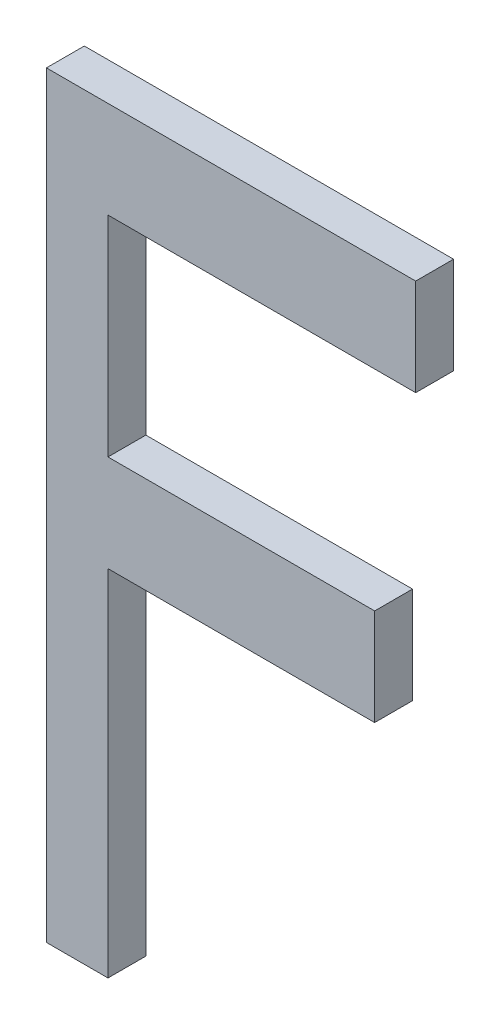
ISO-10303-21;
HEADER;
FILE_DESCRIPTION(('STEP AP214'),'2;1');
FILE_NAME('part.step','',(''),(''),'','','');
FILE_SCHEMA(('AUTOMOTIVE_DESIGN { 1 0 10303 214 1 1 1 1 }'));
ENDSEC;
DATA;
#1=APPLICATION_CONTEXT('core data for automotive mechanical design processes');
#2=APPLICATION_PROTOCOL_DEFINITION('international standard','automotive_design',2000,#1);
#3=PRODUCT_CONTEXT('',#1,'mechanical');
#4=PRODUCT('Part','Part','',(#3));
#5=PRODUCT_RELATED_PRODUCT_CATEGORY('part','',(#4));
#6=PRODUCT_DEFINITION_FORMATION('','',#4);
#7=PRODUCT_DEFINITION_CONTEXT('part definition',#1,'design');
#8=PRODUCT_DEFINITION('design','',#6,#7);
#9=PRODUCT_DEFINITION_SHAPE('','',#8);
#10=(LENGTH_UNIT() NAMED_UNIT(*) SI_UNIT(.MILLI.,.METRE.));
#11=(NAMED_UNIT(*) PLANE_ANGLE_UNIT() SI_UNIT($,.RADIAN.));
#12=(NAMED_UNIT(*) SI_UNIT($,.STERADIAN.) SOLID_ANGLE_UNIT());
#13=UNCERTAINTY_MEASURE_WITH_UNIT(LENGTH_MEASURE(1.E-05),#10,'distance_accuracy_value','');
#14=(GEOMETRIC_REPRESENTATION_CONTEXT(3) GLOBAL_UNCERTAINTY_ASSIGNED_CONTEXT((#13)) GLOBAL_UNIT_ASSIGNED_CONTEXT((#10,
#11,#12)) REPRESENTATION_CONTEXT('',''));
#15=CARTESIAN_POINT('',(0.,0.,0.));
#16=DIRECTION('',(0.,0.,1.));
#17=DIRECTION('',(1.,0.,0.));
#18=AXIS2_PLACEMENT_3D('',#15,#16,#17);
#19=CARTESIAN_POINT('',(90.4148311135074,28.2906710184784,5.9));
#20=DIRECTION('',(0.,0.,1.));
#21=DIRECTION('',(1.,0.,0.));
#22=AXIS2_PLACEMENT_3D('',#19,#20,#21);
#23=PLANE('',#22);
#24=DIRECTION('',(1.,0.,0.));
#25=VECTOR('',#24,1.);
#26=CARTESIAN_POINT('',(90.4148311135074,30.2906710184783,5.9));
#27=LINE('',#26,#25);
#28=CARTESIAN_POINT('',(91.3898311135074,30.2906710184783,5.9));
#29=VERTEX_POINT('',#28);
#30=CARTESIAN_POINT('',(90.4148311135074,30.2906710184783,5.9));
#31=VERTEX_POINT('',#30);
#32=EDGE_CURVE('E126',#29,#31,#27,.F.);
#33=ORIENTED_EDGE('',*,*,#32,.F.);
#34=DIRECTION('',(0.,1.,0.));
#35=VECTOR('',#34,1.);
#36=CARTESIAN_POINT('',(91.3898311135074,28.2906710184784,5.9));
#37=LINE('',#36,#35);
#38=CARTESIAN_POINT('',(91.3898311135074,30.0353518999783,5.9));
#39=VERTEX_POINT('',#38);
#40=EDGE_CURVE('E124',#39,#29,#37,.T.);
#41=ORIENTED_EDGE('',*,*,#40,.F.);
#42=DIRECTION('',(1.,0.,0.));
#43=VECTOR('',#42,1.);
#44=CARTESIAN_POINT('',(90.4148311135074,30.0353518999783,5.9));
#45=LINE('',#44,#43);
#46=CARTESIAN_POINT('',(90.5773311135074,30.0353518999783,5.9));
#47=VERTEX_POINT('',#46);
#48=EDGE_CURVE('E122',#47,#39,#45,.T.);
#49=ORIENTED_EDGE('',*,*,#48,.F.);
#50=DIRECTION('',(0.,1.,0.));
#51=VECTOR('',#50,1.);
#52=CARTESIAN_POINT('',(90.5773311135074,28.2906710184784,5.9));
#53=LINE('',#52,#51);
#54=CARTESIAN_POINT('',(90.5773311135074,29.4821603573583,5.9));
#55=VERTEX_POINT('',#54);
#56=EDGE_CURVE('E120',#55,#47,#53,.T.);
#57=ORIENTED_EDGE('',*,*,#56,.F.);
#58=DIRECTION('',(1.,0.,0.));
#59=VECTOR('',#58,1.);
#60=CARTESIAN_POINT('',(90.4148311135074,29.4821603573583,5.9));
#61=LINE('',#60,#59);
#62=CARTESIAN_POINT('',(91.2814978060074,29.4821603573583,5.9));
#63=VERTEX_POINT('',#62);
#64=EDGE_CURVE('E118',#63,#55,#61,.F.);
#65=ORIENTED_EDGE('',*,*,#64,.F.);
#66=DIRECTION('',(0.,1.,0.));
#67=VECTOR('',#66,1.);
#68=CARTESIAN_POINT('',(91.2814978060074,28.2906710184784,5.9));
#69=LINE('',#68,#67);
#70=CARTESIAN_POINT('',(91.2814978060074,29.2268412388584,5.9));
#71=VERTEX_POINT('',#70);
#72=EDGE_CURVE('E114',#71,#63,#69,.T.);
#73=ORIENTED_EDGE('',*,*,#72,.F.);
#74=DIRECTION('',(1.,0.,0.));
#75=VECTOR('',#74,1.);
#76=CARTESIAN_POINT('',(90.4148311135074,29.2268412388584,5.9));
#77=LINE('',#76,#75);
#78=CARTESIAN_POINT('',(90.5773311135074,29.2268412388584,5.9));
#79=VERTEX_POINT('',#78);
#80=EDGE_CURVE('E113',#79,#71,#77,.T.);
#81=ORIENTED_EDGE('',*,*,#80,.F.);
#82=DIRECTION('',(0.,1.,0.));
#83=VECTOR('',#82,1.);
#84=CARTESIAN_POINT('',(90.5773311135074,28.2906710184784,5.9));
#85=LINE('',#84,#83);
#86=CARTESIAN_POINT('',(90.5773311135074,28.2906710184784,5.9));
#87=VERTEX_POINT('',#86);
#88=EDGE_CURVE('E91',#87,#79,#85,.T.);
#89=ORIENTED_EDGE('',*,*,#88,.F.);
#90=DIRECTION('',(1.,0.,0.));
#91=VECTOR('',#90,1.);
#92=CARTESIAN_POINT('',(90.4148311135074,28.2906710184784,5.9));
#93=LINE('',#92,#91);
#94=CARTESIAN_POINT('',(90.4148311135074,28.2906710184784,5.9));
#95=VERTEX_POINT('',#94);
#96=EDGE_CURVE('E20',#95,#87,#93,.T.);
#97=ORIENTED_EDGE('',*,*,#96,.F.);
#98=DIRECTION('',(0.,1.,0.));
#99=VECTOR('',#98,1.);
#100=CARTESIAN_POINT('',(90.4148311135074,30.2906710184783,5.9));
#101=LINE('',#100,#99);
#102=EDGE_CURVE('E128',#95,#31,#101,.T.);
#103=ORIENTED_EDGE('',*,*,#102,.T.);
#104=EDGE_LOOP('',(#33,#41,#49,#57,#65,#73,#81,#89,#97,#103));
#105=FACE_BOUND('',#104,.T.);
#106=ADVANCED_FACE('F17',(#105),#23,.F.);
#107=CARTESIAN_POINT('',(90.4148311135074,30.2906710184783,6.));
#108=DIRECTION('',(1.,0.,0.));
#109=DIRECTION('',(0.,0.,-1.));
#110=AXIS2_PLACEMENT_3D('',#107,#108,#109);
#111=PLANE('',#110);
#112=DIRECTION('',(0.,0.,1.));
#113=VECTOR('',#112,1.);
#114=CARTESIAN_POINT('',(90.4148311135074,28.2906710184784,6.));
#115=LINE('',#114,#113);
#116=CARTESIAN_POINT('',(90.4148311135074,28.2906710184784,6.));
#117=VERTEX_POINT('',#116);
#118=EDGE_CURVE('E100',#95,#117,#115,.T.);
#119=ORIENTED_EDGE('',*,*,#118,.T.);
#120=DIRECTION('',(0.,1.,0.));
#121=VECTOR('',#120,1.);
#122=CARTESIAN_POINT('',(90.4148311135074,28.2906710184784,6.));
#123=LINE('',#122,#121);
#124=CARTESIAN_POINT('',(90.4148311135074,30.2906710184783,6.));
#125=VERTEX_POINT('',#124);
#126=EDGE_CURVE('E146',#125,#117,#123,.F.);
#127=ORIENTED_EDGE('',*,*,#126,.F.);
#128=DIRECTION('',(0.,0.,-1.));
#129=VECTOR('',#128,1.);
#130=CARTESIAN_POINT('',(90.4148311135074,30.2906710184783,6.));
#131=LINE('',#130,#129);
#132=EDGE_CURVE('E143',#125,#31,#131,.T.);
#133=ORIENTED_EDGE('',*,*,#132,.T.);
#134=ORIENTED_EDGE('',*,*,#102,.F.);
#135=EDGE_LOOP('',(#119,#127,#133,#134));
#136=FACE_BOUND('',#135,.T.);
#137=ADVANCED_FACE('F181',(#136),#111,.F.);
#138=CARTESIAN_POINT('',(90.4148311135074,28.2906710184784,6.));
#139=DIRECTION('',(0.,1.,0.));
#140=DIRECTION('',(0.,0.,1.));
#141=AXIS2_PLACEMENT_3D('',#138,#139,#140);
#142=PLANE('',#141);
#143=DIRECTION('',(0.,0.,1.));
#144=VECTOR('',#143,1.);
#145=CARTESIAN_POINT('',(90.5773311135074,28.2906710184784,6.));
#146=LINE('',#145,#144);
#147=CARTESIAN_POINT('',(90.5773311135074,28.2906710184784,6.));
#148=VERTEX_POINT('',#147);
#149=EDGE_CURVE('E98',#87,#148,#146,.T.);
#150=ORIENTED_EDGE('',*,*,#149,.T.);
#151=DIRECTION('',(1.,0.,0.));
#152=VECTOR('',#151,1.);
#153=CARTESIAN_POINT('',(90.4148311135074,28.2906710184784,6.));
#154=LINE('',#153,#152);
#155=EDGE_CURVE('E149',#117,#148,#154,.T.);
#156=ORIENTED_EDGE('',*,*,#155,.F.);
#157=ORIENTED_EDGE('',*,*,#118,.F.);
#158=ORIENTED_EDGE('',*,*,#96,.T.);
#159=EDGE_LOOP('',(#150,#156,#157,#158));
#160=FACE_BOUND('',#159,.T.);
#161=ADVANCED_FACE('F96',(#160),#142,.F.);
#162=CARTESIAN_POINT('',(90.5773311135074,28.2906710184784,6.));
#163=DIRECTION('',(-1.,0.,0.));
#164=DIRECTION('',(0.,0.,1.));
#165=AXIS2_PLACEMENT_3D('',#162,#163,#164);
#166=PLANE('',#165);
#167=DIRECTION('',(0.,0.,1.));
#168=VECTOR('',#167,1.);
#169=CARTESIAN_POINT('',(90.5773311135074,29.2268412388584,6.));
#170=LINE('',#169,#168);
#171=CARTESIAN_POINT('',(90.5773311135074,29.2268412388584,6.));
#172=VERTEX_POINT('',#171);
#173=EDGE_CURVE('E108',#79,#172,#170,.T.);
#174=ORIENTED_EDGE('',*,*,#173,.T.);
#175=DIRECTION('',(0.,1.,0.));
#176=VECTOR('',#175,1.);
#177=CARTESIAN_POINT('',(90.5773311135074,28.2906710184784,6.));
#178=LINE('',#177,#176);
#179=EDGE_CURVE('E106',#148,#172,#178,.T.);
#180=ORIENTED_EDGE('',*,*,#179,.F.);
#181=ORIENTED_EDGE('',*,*,#149,.F.);
#182=ORIENTED_EDGE('',*,*,#88,.T.);
#183=EDGE_LOOP('',(#174,#180,#181,#182));
#184=FACE_BOUND('',#183,.T.);
#185=ADVANCED_FACE('F104',(#184),#166,.F.);
#186=CARTESIAN_POINT('',(90.5773311135074,29.2268412388584,6.));
#187=DIRECTION('',(0.,1.,0.));
#188=DIRECTION('',(0.,0.,1.));
#189=AXIS2_PLACEMENT_3D('',#186,#187,#188);
#190=PLANE('',#189);
#191=DIRECTION('',(0.,0.,1.));
#192=VECTOR('',#191,1.);
#193=CARTESIAN_POINT('',(91.2814978060074,29.2268412388584,6.));
#194=LINE('',#193,#192);
#195=CARTESIAN_POINT('',(91.2814978060074,29.2268412388584,6.));
#196=VERTEX_POINT('',#195);
#197=EDGE_CURVE('E132',#71,#196,#194,.T.);
#198=ORIENTED_EDGE('',*,*,#197,.T.);
#199=DIRECTION('',(1.,0.,0.));
#200=VECTOR('',#199,1.);
#201=CARTESIAN_POINT('',(90.4148311135074,29.2268412388584,6.));
#202=LINE('',#201,#200);
#203=EDGE_CURVE('E152',#172,#196,#202,.T.);
#204=ORIENTED_EDGE('',*,*,#203,.F.);
#205=ORIENTED_EDGE('',*,*,#173,.F.);
#206=ORIENTED_EDGE('',*,*,#80,.T.);
#207=EDGE_LOOP('',(#198,#204,#205,#206));
#208=FACE_BOUND('',#207,.T.);
#209=ADVANCED_FACE('F185',(#208),#190,.F.);
#210=CARTESIAN_POINT('',(91.2814978060074,29.2268412388584,6.));
#211=DIRECTION('',(-1.,0.,0.));
#212=DIRECTION('',(0.,0.,1.));
#213=AXIS2_PLACEMENT_3D('',#210,#211,#212);
#214=PLANE('',#213);
#215=DIRECTION('',(0.,0.,-1.));
#216=VECTOR('',#215,1.);
#217=CARTESIAN_POINT('',(91.2814978060074,29.4821603573583,6.));
#218=LINE('',#217,#216);
#219=CARTESIAN_POINT('',(91.2814978060074,29.4821603573583,6.));
#220=VERTEX_POINT('',#219);
#221=EDGE_CURVE('E134',#63,#220,#218,.F.);
#222=ORIENTED_EDGE('',*,*,#221,.T.);
#223=DIRECTION('',(0.,1.,0.));
#224=VECTOR('',#223,1.);
#225=CARTESIAN_POINT('',(91.2814978060074,28.2906710184784,6.));
#226=LINE('',#225,#224);
#227=EDGE_CURVE('E155',#196,#220,#226,.T.);
#228=ORIENTED_EDGE('',*,*,#227,.F.);
#229=ORIENTED_EDGE('',*,*,#197,.F.);
#230=ORIENTED_EDGE('',*,*,#72,.T.);
#231=EDGE_LOOP('',(#222,#228,#229,#230));
#232=FACE_BOUND('',#231,.T.);
#233=ADVANCED_FACE('F188',(#232),#214,.F.);
#234=CARTESIAN_POINT('',(91.2814978060074,29.4821603573583,6.));
#235=DIRECTION('',(0.,-1.,0.));
#236=DIRECTION('',(0.,0.,-1.));
#237=AXIS2_PLACEMENT_3D('',#234,#235,#236);
#238=PLANE('',#237);
#239=DIRECTION('',(0.,0.,1.));
#240=VECTOR('',#239,1.);
#241=CARTESIAN_POINT('',(90.5773311135074,29.4821603573583,6.));
#242=LINE('',#241,#240);
#243=CARTESIAN_POINT('',(90.5773311135074,29.4821603573583,6.));
#244=VERTEX_POINT('',#243);
#245=EDGE_CURVE('E136',#55,#244,#242,.T.);
#246=ORIENTED_EDGE('',*,*,#245,.T.);
#247=DIRECTION('',(1.,0.,0.));
#248=VECTOR('',#247,1.);
#249=CARTESIAN_POINT('',(90.4148311135074,29.4821603573583,6.));
#250=LINE('',#249,#248);
#251=EDGE_CURVE('E158',#220,#244,#250,.F.);
#252=ORIENTED_EDGE('',*,*,#251,.F.);
#253=ORIENTED_EDGE('',*,*,#221,.F.);
#254=ORIENTED_EDGE('',*,*,#64,.T.);
#255=EDGE_LOOP('',(#246,#252,#253,#254));
#256=FACE_BOUND('',#255,.T.);
#257=ADVANCED_FACE('F193',(#256),#238,.F.);
#258=CARTESIAN_POINT('',(90.5773311135074,29.4821603573583,6.));
#259=DIRECTION('',(-1.,0.,0.));
#260=DIRECTION('',(0.,0.,1.));
#261=AXIS2_PLACEMENT_3D('',#258,#259,#260);
#262=PLANE('',#261);
#263=DIRECTION('',(0.,0.,1.));
#264=VECTOR('',#263,1.);
#265=CARTESIAN_POINT('',(90.5773311135074,30.0353518999783,6.));
#266=LINE('',#265,#264);
#267=CARTESIAN_POINT('',(90.5773311135074,30.0353518999783,6.));
#268=VERTEX_POINT('',#267);
#269=EDGE_CURVE('E138',#47,#268,#266,.T.);
#270=ORIENTED_EDGE('',*,*,#269,.T.);
#271=DIRECTION('',(0.,1.,0.));
#272=VECTOR('',#271,1.);
#273=CARTESIAN_POINT('',(90.5773311135074,28.2906710184784,6.));
#274=LINE('',#273,#272);
#275=EDGE_CURVE('E161',#244,#268,#274,.T.);
#276=ORIENTED_EDGE('',*,*,#275,.F.);
#277=ORIENTED_EDGE('',*,*,#245,.F.);
#278=ORIENTED_EDGE('',*,*,#56,.T.);
#279=EDGE_LOOP('',(#270,#276,#277,#278));
#280=FACE_BOUND('',#279,.T.);
#281=ADVANCED_FACE('F197',(#280),#262,.F.);
#282=CARTESIAN_POINT('',(90.5773311135074,30.0353518999783,6.));
#283=DIRECTION('',(0.,1.,0.));
#284=DIRECTION('',(0.,0.,1.));
#285=AXIS2_PLACEMENT_3D('',#282,#283,#284);
#286=PLANE('',#285);
#287=DIRECTION('',(0.,0.,1.));
#288=VECTOR('',#287,1.);
#289=CARTESIAN_POINT('',(91.3898311135074,30.0353518999783,6.));
#290=LINE('',#289,#288);
#291=CARTESIAN_POINT('',(91.3898311135074,30.0353518999783,6.));
#292=VERTEX_POINT('',#291);
#293=EDGE_CURVE('E140',#39,#292,#290,.T.);
#294=ORIENTED_EDGE('',*,*,#293,.T.);
#295=DIRECTION('',(1.,0.,0.));
#296=VECTOR('',#295,1.);
#297=CARTESIAN_POINT('',(90.4148311135074,30.0353518999783,6.));
#298=LINE('',#297,#296);
#299=EDGE_CURVE('E164',#268,#292,#298,.T.);
#300=ORIENTED_EDGE('',*,*,#299,.F.);
#301=ORIENTED_EDGE('',*,*,#269,.F.);
#302=ORIENTED_EDGE('',*,*,#48,.T.);
#303=EDGE_LOOP('',(#294,#300,#301,#302));
#304=FACE_BOUND('',#303,.T.);
#305=ADVANCED_FACE('F199',(#304),#286,.F.);
#306=CARTESIAN_POINT('',(91.3898311135074,30.0353518999783,6.));
#307=DIRECTION('',(-1.,0.,0.));
#308=DIRECTION('',(0.,0.,1.));
#309=AXIS2_PLACEMENT_3D('',#306,#307,#308);
#310=PLANE('',#309);
#311=DIRECTION('',(0.,0.,-1.));
#312=VECTOR('',#311,1.);
#313=CARTESIAN_POINT('',(91.3898311135074,30.2906710184783,6.));
#314=LINE('',#313,#312);
#315=CARTESIAN_POINT('',(91.3898311135074,30.2906710184783,6.));
#316=VERTEX_POINT('',#315);
#317=EDGE_CURVE('E35',#29,#316,#314,.F.);
#318=ORIENTED_EDGE('',*,*,#317,.T.);
#319=DIRECTION('',(0.,1.,0.));
#320=VECTOR('',#319,1.);
#321=CARTESIAN_POINT('',(91.3898311135074,28.2906710184784,6.));
#322=LINE('',#321,#320);
#323=EDGE_CURVE('E26',#292,#316,#322,.T.);
#324=ORIENTED_EDGE('',*,*,#323,.F.);
#325=ORIENTED_EDGE('',*,*,#293,.F.);
#326=ORIENTED_EDGE('',*,*,#40,.T.);
#327=EDGE_LOOP('',(#318,#324,#325,#326));
#328=FACE_BOUND('',#327,.T.);
#329=ADVANCED_FACE('F172',(#328),#310,.F.);
#330=CARTESIAN_POINT('',(91.3898311135074,30.2906710184783,6.));
#331=DIRECTION('',(0.,-1.,0.));
#332=DIRECTION('',(0.,0.,-1.));
#333=AXIS2_PLACEMENT_3D('',#330,#331,#332);
#334=PLANE('',#333);
#335=ORIENTED_EDGE('',*,*,#132,.F.);
#336=DIRECTION('',(1.,0.,0.));
#337=VECTOR('',#336,1.);
#338=CARTESIAN_POINT('',(90.4148311135074,30.2906710184783,6.));
#339=LINE('',#338,#337);
#340=EDGE_CURVE('E11',#316,#125,#339,.F.);
#341=ORIENTED_EDGE('',*,*,#340,.F.);
#342=ORIENTED_EDGE('',*,*,#317,.F.);
#343=ORIENTED_EDGE('',*,*,#32,.T.);
#344=EDGE_LOOP('',(#335,#341,#342,#343));
#345=FACE_BOUND('',#344,.T.);
#346=ADVANCED_FACE('F179',(#345),#334,.F.);
#347=CARTESIAN_POINT('',(90.4148311135074,28.2906710184784,6.));
#348=DIRECTION('',(0.,0.,1.));
#349=DIRECTION('',(1.,0.,0.));
#350=AXIS2_PLACEMENT_3D('',#347,#348,#349);
#351=PLANE('',#350);
#352=ORIENTED_EDGE('',*,*,#323,.T.);
#353=ORIENTED_EDGE('',*,*,#340,.T.);
#354=ORIENTED_EDGE('',*,*,#126,.T.);
#355=ORIENTED_EDGE('',*,*,#155,.T.);
#356=ORIENTED_EDGE('',*,*,#179,.T.);
#357=ORIENTED_EDGE('',*,*,#203,.T.);
#358=ORIENTED_EDGE('',*,*,#227,.T.);
#359=ORIENTED_EDGE('',*,*,#251,.T.);
#360=ORIENTED_EDGE('',*,*,#275,.T.);
#361=ORIENTED_EDGE('',*,*,#299,.T.);
#362=EDGE_LOOP('',(#352,#353,#354,#355,#356,#357,#358,#359,#360,#361));
#363=FACE_BOUND('',#362,.T.);
#364=ADVANCED_FACE('F169',(#363),#351,.T.);
#365=CLOSED_SHELL('',(#106,#137,#161,#185,#209,#233,#257,#281,#305,#329,#346,#364));
#366=MANIFOLD_SOLID_BREP('B1',#365);
#367=ADVANCED_BREP_SHAPE_REPRESENTATION('',(#18,#366),#14);
#368=SHAPE_DEFINITION_REPRESENTATION(#9,#367);
ENDSEC;
END-ISO-10303-21;
